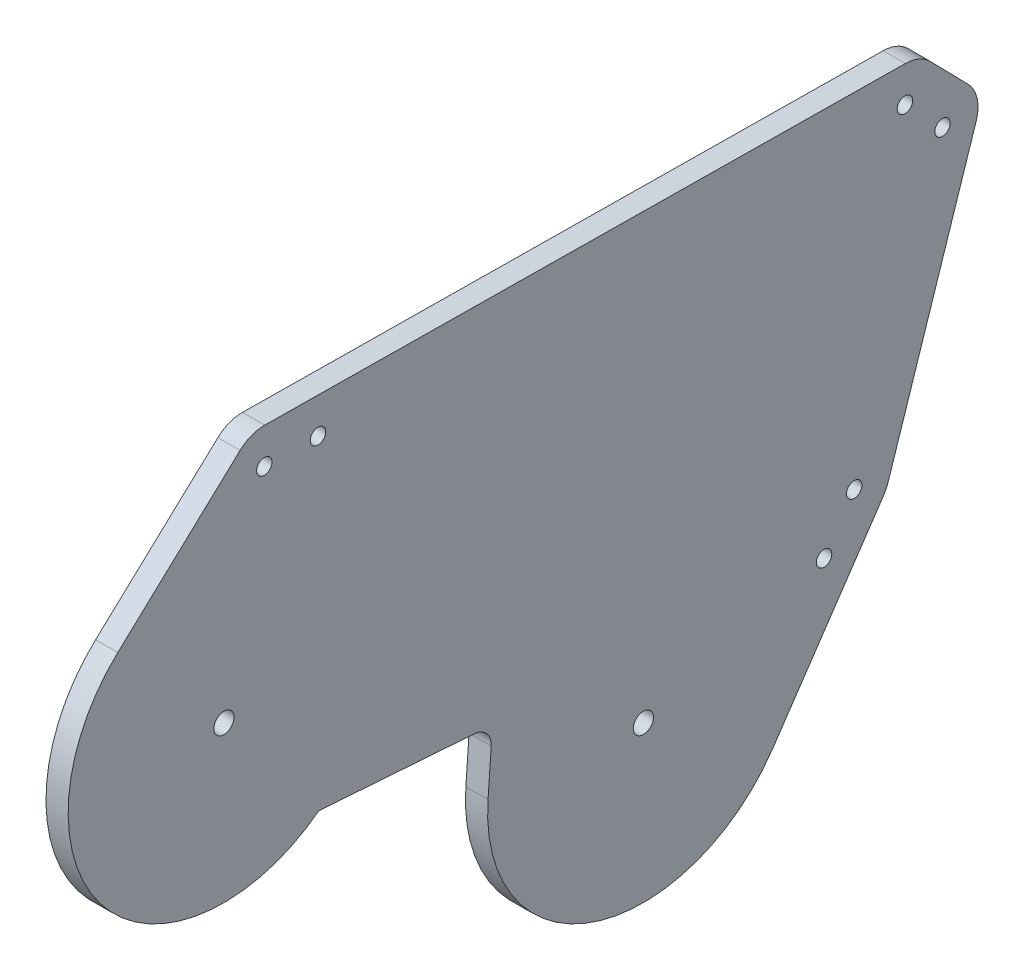
ISO-10303-21;
HEADER;
FILE_DESCRIPTION(('STEP AP214'),'2;1');
FILE_NAME('part.step','',(''),(''),'','','');
FILE_SCHEMA(('AUTOMOTIVE_DESIGN { 1 0 10303 214 1 1 1 1 }'));
ENDSEC;
DATA;
#1=APPLICATION_CONTEXT('core data for automotive mechanical design processes');
#2=APPLICATION_PROTOCOL_DEFINITION('international standard','automotive_design',2000,#1);
#3=PRODUCT_CONTEXT('',#1,'mechanical');
#4=PRODUCT('Part','Part','',(#3));
#5=PRODUCT_RELATED_PRODUCT_CATEGORY('part','',(#4));
#6=PRODUCT_DEFINITION_FORMATION('','',#4);
#7=PRODUCT_DEFINITION_CONTEXT('part definition',#1,'design');
#8=PRODUCT_DEFINITION('design','',#6,#7);
#9=PRODUCT_DEFINITION_SHAPE('','',#8);
#10=(LENGTH_UNIT() NAMED_UNIT(*) SI_UNIT(.MILLI.,.METRE.));
#11=(NAMED_UNIT(*) PLANE_ANGLE_UNIT() SI_UNIT($,.RADIAN.));
#12=(NAMED_UNIT(*) SI_UNIT($,.STERADIAN.) SOLID_ANGLE_UNIT());
#13=UNCERTAINTY_MEASURE_WITH_UNIT(LENGTH_MEASURE(1.E-05),#10,'distance_accuracy_value','');
#14=(GEOMETRIC_REPRESENTATION_CONTEXT(3) GLOBAL_UNCERTAINTY_ASSIGNED_CONTEXT((#13)) GLOBAL_UNIT_ASSIGNED_CONTEXT((#10,
#11,#12)) REPRESENTATION_CONTEXT('',''));
#15=CARTESIAN_POINT('',(0.,0.,0.));
#16=DIRECTION('',(0.,0.,1.));
#17=DIRECTION('',(1.,0.,0.));
#18=AXIS2_PLACEMENT_3D('',#15,#16,#17);
#19=CARTESIAN_POINT('',(-4.953,-61.8421896626251,426.087206182307));
#20=DIRECTION('',(1.,0.,0.));
#21=DIRECTION('',(0.,0.,-1.));
#22=AXIS2_PLACEMENT_3D('',#19,#20,#21);
#23=CYLINDRICAL_SURFACE('',#22,34.8040999999982);
#24=CARTESIAN_POINT('',(0.,-61.8421896626251,426.087206182307));
#25=DIRECTION('',(1.,0.,0.));
#26=DIRECTION('',(0.,0.,-1.));
#27=AXIS2_PLACEMENT_3D('',#24,#25,#26);
#28=CIRCLE('',#27,34.8040999999982);
#29=CARTESIAN_POINT('',(0.,-59.3477658780429,460.801802921903));
#30=VERTEX_POINT('',#29);
#31=CARTESIAN_POINT('',(0.,-81.3641503491376,397.273694980717));
#32=VERTEX_POINT('',#31);
#33=EDGE_CURVE('E171',#30,#32,#28,.T.);
#34=ORIENTED_EDGE('',*,*,#33,.F.);
#35=DIRECTION('',(1.,0.,0.));
#36=VECTOR('',#35,1.);
#37=CARTESIAN_POINT('',(-4.953,-59.3477658780429,460.801802921903));
#38=LINE('',#37,#36);
#39=CARTESIAN_POINT('',(-4.953,-59.3477658780429,460.801802921903));
#40=VERTEX_POINT('',#39);
#41=EDGE_CURVE('E12',#40,#30,#38,.T.);
#42=ORIENTED_EDGE('',*,*,#41,.F.);
#43=CARTESIAN_POINT('',(-4.953,-61.8421896626251,426.087206182307));
#44=DIRECTION('',(1.,0.,0.));
#45=DIRECTION('',(0.,0.,-1.));
#46=AXIS2_PLACEMENT_3D('',#43,#44,#45);
#47=CIRCLE('',#46,34.8040999999982);
#48=CARTESIAN_POINT('',(-4.953,-81.3641503491376,397.273694980717));
#49=VERTEX_POINT('',#48);
#50=EDGE_CURVE('E246',#40,#49,#47,.T.);
#51=ORIENTED_EDGE('',*,*,#50,.T.);
#52=DIRECTION('',(1.,0.,0.));
#53=VECTOR('',#52,1.);
#54=CARTESIAN_POINT('',(-4.953,-81.3641503491376,397.273694980717));
#55=LINE('',#54,#53);
#56=EDGE_CURVE('E41',#49,#32,#55,.T.);
#57=ORIENTED_EDGE('',*,*,#56,.T.);
#58=EDGE_LOOP('',(#34,#42,#51,#57));
#59=FACE_BOUND('',#58,.T.);
#60=ADVANCED_FACE('F38',(#59),#23,.T.);
#61=CARTESIAN_POINT('',(-4.953,-59.3477658780429,460.801802921903));
#62=DIRECTION('',(0.,0.0716704004580626,0.9974283702092));
#63=DIRECTION('',(0.,-0.9974283702092,0.0716704004580626));
#64=AXIS2_PLACEMENT_3D('',#61,#62,#63);
#65=PLANE('',#64);
#66=DIRECTION('',(0.,-0.9974283702092,0.0716704004580626));
#67=VECTOR('',#66,1.);
#68=CARTESIAN_POINT('',(0.,-59.3477658780429,460.801802921903));
#69=LINE('',#68,#67);
#70=CARTESIAN_POINT('',(0.,-49.3734821759509,460.085098917322));
#71=VERTEX_POINT('',#70);
#72=EDGE_CURVE('E242',#71,#30,#69,.T.);
#73=ORIENTED_EDGE('',*,*,#72,.F.);
#74=DIRECTION('',(1.,0.,0.));
#75=VECTOR('',#74,1.);
#76=CARTESIAN_POINT('',(-4.953,-49.3734821759509,460.085098917322));
#77=LINE('',#76,#75);
#78=CARTESIAN_POINT('',(-4.953,-49.3734821759509,460.085098917322));
#79=VERTEX_POINT('',#78);
#80=EDGE_CURVE('E47',#79,#71,#77,.T.);
#81=ORIENTED_EDGE('',*,*,#80,.F.);
#82=DIRECTION('',(0.,-0.9974283702092,0.0716704004580626));
#83=VECTOR('',#82,1.);
#84=CARTESIAN_POINT('',(-4.953,-59.3477658780429,460.801802921903));
#85=LINE('',#84,#83);
#86=EDGE_CURVE('E161',#79,#40,#85,.T.);
#87=ORIENTED_EDGE('',*,*,#86,.T.);
#88=ORIENTED_EDGE('',*,*,#41,.T.);
#89=EDGE_LOOP('',(#73,#81,#87,#88));
#90=FACE_BOUND('',#89,.T.);
#91=ADVANCED_FACE('F272',(#90),#65,.T.);
#92=CARTESIAN_POINT('',(-4.953,-49.0868005741186,464.074812398159));
#93=DIRECTION('',(1.,0.,0.));
#94=DIRECTION('',(0.,0.,-1.));
#95=AXIS2_PLACEMENT_3D('',#92,#93,#94);
#96=CYLINDRICAL_SURFACE('',#95,4.);
#97=CARTESIAN_POINT('',(0.,-49.0868005741186,464.074812398159));
#98=DIRECTION('',(-1.,0.,0.));
#99=DIRECTION('',(0.,0.,1.));
#100=AXIS2_PLACEMENT_3D('',#97,#98,#99);
#101=CIRCLE('',#100,4.);
#102=CARTESIAN_POINT('',(0.,-45.0970870932818,463.788130796327));
#103=VERTEX_POINT('',#102);
#104=EDGE_CURVE('E148',#103,#71,#101,.T.);
#105=ORIENTED_EDGE('',*,*,#104,.F.);
#106=DIRECTION('',(1.,0.,0.));
#107=VECTOR('',#106,1.);
#108=CARTESIAN_POINT('',(-4.953,-45.0970870932818,463.788130796327));
#109=LINE('',#108,#107);
#110=CARTESIAN_POINT('',(-4.953,-45.0970870932818,463.788130796327));
#111=VERTEX_POINT('',#110);
#112=EDGE_CURVE('E143',#111,#103,#109,.T.);
#113=ORIENTED_EDGE('',*,*,#112,.F.);
#114=CARTESIAN_POINT('',(-4.953,-49.0868005741186,464.074812398159));
#115=DIRECTION('',(-1.,0.,0.));
#116=DIRECTION('',(0.,0.,1.));
#117=AXIS2_PLACEMENT_3D('',#114,#115,#116);
#118=CIRCLE('',#117,4.);
#119=EDGE_CURVE('E146',#111,#79,#118,.T.);
#120=ORIENTED_EDGE('',*,*,#119,.T.);
#121=ORIENTED_EDGE('',*,*,#80,.T.);
#122=EDGE_LOOP('',(#105,#113,#120,#121));
#123=FACE_BOUND('',#122,.T.);
#124=ADVANCED_FACE('F145',(#123),#96,.F.);
#125=CARTESIAN_POINT('',(-4.953,-42.5978831750404,498.569252082941));
#126=DIRECTION('',(0.,-0.9974283702092,0.0716704004580605));
#127=DIRECTION('',(0.,-0.0716704004580605,-0.9974283702092));
#128=AXIS2_PLACEMENT_3D('',#125,#126,#127);
#129=PLANE('',#128);
#130=DIRECTION('',(0.,-0.0716704004580605,-0.9974283702092));
#131=VECTOR('',#130,1.);
#132=CARTESIAN_POINT('',(0.,-42.5978831750404,498.569252082941));
#133=LINE('',#132,#131);
#134=CARTESIAN_POINT('',(0.,-42.5978831750405,498.569252082941));
#135=VERTEX_POINT('',#134);
#136=EDGE_CURVE('E236',#135,#103,#133,.T.);
#137=ORIENTED_EDGE('',*,*,#136,.F.);
#138=DIRECTION('',(1.,0.,0.));
#139=VECTOR('',#138,1.);
#140=CARTESIAN_POINT('',(-4.953,-42.5978831750405,498.569252082941));
#141=LINE('',#140,#139);
#142=CARTESIAN_POINT('',(-4.953,-42.5978831750405,498.569252082941));
#143=VERTEX_POINT('',#142);
#144=EDGE_CURVE('E153',#143,#135,#141,.T.);
#145=ORIENTED_EDGE('',*,*,#144,.F.);
#146=DIRECTION('',(0.,-0.0716704004580605,-0.9974283702092));
#147=VECTOR('',#146,1.);
#148=CARTESIAN_POINT('',(-4.953,-42.5978831750404,498.569252082941));
#149=LINE('',#148,#147);
#150=EDGE_CURVE('E159',#143,#111,#149,.T.);
#151=ORIENTED_EDGE('',*,*,#150,.T.);
#152=ORIENTED_EDGE('',*,*,#112,.T.);
#153=EDGE_LOOP('',(#137,#145,#151,#152));
#154=FACE_BOUND('',#153,.T.);
#155=ADVANCED_FACE('F163',(#154),#129,.T.);
#156=CARTESIAN_POINT('',(-4.953,-15.0065003575197,519.783421192923));
#157=DIRECTION('',(1.,0.,0.));
#158=DIRECTION('',(0.,0.,-1.));
#159=AXIS2_PLACEMENT_3D('',#156,#157,#158);
#160=CYLINDRICAL_SURFACE('',#159,34.8040999999986);
#161=CARTESIAN_POINT('',(0.,-15.0065003575197,519.783421192923));
#162=DIRECTION('',(1.,0.,0.));
#163=DIRECTION('',(0.,0.,-1.));
#164=AXIS2_PLACEMENT_3D('',#161,#162,#163);
#165=CIRCLE('',#164,34.8040999999986);
#166=CARTESIAN_POINT('',(0.,10.4622867101941,543.504008498244));
#167=VERTEX_POINT('',#166);
#168=EDGE_CURVE('E232',#167,#135,#165,.T.);
#169=ORIENTED_EDGE('',*,*,#168,.F.);
#170=DIRECTION('',(1.,0.,0.));
#171=VECTOR('',#170,1.);
#172=CARTESIAN_POINT('',(-4.953,10.4622867101941,543.504008498244));
#173=LINE('',#172,#171);
#174=CARTESIAN_POINT('',(-4.953,10.4622867101941,543.504008498244));
#175=VERTEX_POINT('',#174);
#176=EDGE_CURVE('E250',#175,#167,#173,.T.);
#177=ORIENTED_EDGE('',*,*,#176,.F.);
#178=CARTESIAN_POINT('',(-4.953,-15.0065003575197,519.783421192923));
#179=DIRECTION('',(1.,0.,0.));
#180=DIRECTION('',(0.,0.,-1.));
#181=AXIS2_PLACEMENT_3D('',#178,#179,#180);
#182=CIRCLE('',#181,34.8040999999986);
#183=EDGE_CURVE('E164',#175,#143,#182,.T.);
#184=ORIENTED_EDGE('',*,*,#183,.T.);
#185=ORIENTED_EDGE('',*,*,#144,.T.);
#186=EDGE_LOOP('',(#169,#177,#184,#185));
#187=FACE_BOUND('',#186,.T.);
#188=ADVANCED_FACE('F285',(#187),#160,.T.);
#189=CARTESIAN_POINT('',(-4.953,35.9103864393411,516.180391888878));
#190=DIRECTION('',(0.,0.7317754824206,0.681545774932321));
#191=DIRECTION('',(0.,-0.681545774932321,0.7317754824206));
#192=AXIS2_PLACEMENT_3D('',#189,#190,#191);
#193=PLANE('',#192);
#194=DIRECTION('',(0.,-0.681545774932321,0.7317754824206));
#195=VECTOR('',#194,1.);
#196=CARTESIAN_POINT('',(0.,35.9103864393411,516.180391888878));
#197=LINE('',#196,#195);
#198=CARTESIAN_POINT('',(0.,35.9103864393417,516.180391888879));
#199=VERTEX_POINT('',#198);
#200=EDGE_CURVE('E225',#199,#167,#197,.T.);
#201=ORIENTED_EDGE('',*,*,#200,.F.);
#202=DIRECTION('',(1.,0.,0.));
#203=VECTOR('',#202,1.);
#204=CARTESIAN_POINT('',(-4.953,35.9103864393417,516.180391888879));
#205=LINE('',#204,#203);
#206=CARTESIAN_POINT('',(-4.953,35.9103864393417,516.180391888879));
#207=VERTEX_POINT('',#206);
#208=EDGE_CURVE('E252',#207,#199,#205,.T.);
#209=ORIENTED_EDGE('',*,*,#208,.F.);
#210=DIRECTION('',(0.,-0.681545774932321,0.7317754824206));
#211=VECTOR('',#210,1.);
#212=CARTESIAN_POINT('',(-4.953,35.9103864393411,516.180391888878));
#213=LINE('',#212,#211);
#214=EDGE_CURVE('E166',#207,#175,#213,.T.);
#215=ORIENTED_EDGE('',*,*,#214,.T.);
#216=ORIENTED_EDGE('',*,*,#176,.T.);
#217=EDGE_LOOP('',(#201,#209,#215,#216));
#218=FACE_BOUND('',#217,.T.);
#219=ADVANCED_FACE('F288',(#218),#193,.T.);
#220=CARTESIAN_POINT('',(-4.953,30.1019185476259,510.770622300354));
#221=DIRECTION('',(1.,0.,0.));
#222=DIRECTION('',(0.,0.,-1.));
#223=AXIS2_PLACEMENT_3D('',#220,#221,#222);
#224=CYLINDRICAL_SURFACE('',#223,7.93750000000153);
#225=CARTESIAN_POINT('',(0.,30.1019185476259,510.770622300354));
#226=DIRECTION('',(1.,0.,0.));
#227=DIRECTION('',(0.,0.,1.));
#228=AXIS2_PLACEMENT_3D('',#225,#226,#227);
#229=CIRCLE('',#228,7.93750000000153);
#230=CARTESIAN_POINT('',(0.,38.0389259271998,510.682190933593));
#231=VERTEX_POINT('',#230);
#232=EDGE_CURVE('E220',#231,#199,#229,.T.);
#233=ORIENTED_EDGE('',*,*,#232,.F.);
#234=DIRECTION('',(1.,0.,0.));
#235=VECTOR('',#234,1.);
#236=CARTESIAN_POINT('',(-4.953,38.0389259271998,510.682190933593));
#237=LINE('',#236,#235);
#238=CARTESIAN_POINT('',(-4.953,38.0389259271998,510.682190933593));
#239=VERTEX_POINT('',#238);
#240=EDGE_CURVE('E254',#239,#231,#237,.T.);
#241=ORIENTED_EDGE('',*,*,#240,.F.);
#242=CARTESIAN_POINT('',(-4.953,30.1019185476259,510.770622300354));
#243=DIRECTION('',(1.,0.,0.));
#244=DIRECTION('',(0.,0.,1.));
#245=AXIS2_PLACEMENT_3D('',#242,#243,#244);
#246=CIRCLE('',#245,7.93750000000153);
#247=EDGE_CURVE('E455',#239,#207,#246,.T.);
#248=ORIENTED_EDGE('',*,*,#247,.T.);
#249=ORIENTED_EDGE('',*,*,#208,.T.);
#250=EDGE_LOOP('',(#233,#241,#248,#249));
#251=FACE_BOUND('',#250,.T.);
#252=ADVANCED_FACE('F292',(#251),#224,.T.);
#253=CARTESIAN_POINT('',(-4.953,36.4445127908391,367.578343357796));
#254=DIRECTION('',(0.,0.999937937583819,-0.0111409595914925));
#255=DIRECTION('',(0.,0.0111409595914925,0.999937937583819));
#256=AXIS2_PLACEMENT_3D('',#253,#254,#255);
#257=PLANE('',#256);
#258=DIRECTION('',(0.,0.0111409595914925,0.999937937583819));
#259=VECTOR('',#258,1.);
#260=CARTESIAN_POINT('',(0.,36.4445127908391,367.578343357796));
#261=LINE('',#260,#259);
#262=CARTESIAN_POINT('',(0.,36.4445127908391,367.578343357796));
#263=VERTEX_POINT('',#262);
#264=EDGE_CURVE('E215',#263,#231,#261,.T.);
#265=ORIENTED_EDGE('',*,*,#264,.F.);
#266=DIRECTION('',(1.,0.,0.));
#267=VECTOR('',#266,1.);
#268=CARTESIAN_POINT('',(-4.953,36.4445127908391,367.578343357796));
#269=LINE('',#268,#267);
#270=CARTESIAN_POINT('',(-4.953,36.4445127908391,367.578343357796));
#271=VERTEX_POINT('',#270);
#272=EDGE_CURVE('E256',#271,#263,#269,.T.);
#273=ORIENTED_EDGE('',*,*,#272,.F.);
#274=DIRECTION('',(0.,0.0111409595914925,0.999937937583819));
#275=VECTOR('',#274,1.);
#276=CARTESIAN_POINT('',(-4.953,36.4445127908391,367.578343357796));
#277=LINE('',#276,#275);
#278=EDGE_CURVE('E452',#271,#239,#277,.T.);
#279=ORIENTED_EDGE('',*,*,#278,.T.);
#280=ORIENTED_EDGE('',*,*,#240,.T.);
#281=EDGE_LOOP('',(#265,#273,#279,#280));
#282=FACE_BOUND('',#281,.T.);
#283=ADVANCED_FACE('F296',(#282),#257,.T.);
#284=CARTESIAN_POINT('',(-4.953,28.5075054112675,367.666774724554));
#285=DIRECTION('',(1.,0.,0.));
#286=DIRECTION('',(0.,0.,-1.));
#287=AXIS2_PLACEMENT_3D('',#284,#285,#286);
#288=CYLINDRICAL_SURFACE('',#287,7.9375);
#289=CARTESIAN_POINT('',(0.,28.5075054112675,367.666774724554));
#290=DIRECTION('',(1.,0.,0.));
#291=DIRECTION('',(0.,0.,-1.));
#292=AXIS2_PLACEMENT_3D('',#289,#290,#291);
#293=CIRCLE('',#292,7.9375);
#294=CARTESIAN_POINT('',(0.,34.0572867325866,361.991932565027));
#295=VERTEX_POINT('',#294);
#296=EDGE_CURVE('E211',#295,#263,#293,.T.);
#297=ORIENTED_EDGE('',*,*,#296,.F.);
#298=DIRECTION('',(1.,0.,0.));
#299=VECTOR('',#298,1.);
#300=CARTESIAN_POINT('',(-4.953,34.0572867325866,361.991932565027));
#301=LINE('',#300,#299);
#302=CARTESIAN_POINT('',(-4.953,34.0572867325866,361.991932565027));
#303=VERTEX_POINT('',#302);
#304=EDGE_CURVE('E258',#303,#295,#301,.T.);
#305=ORIENTED_EDGE('',*,*,#304,.F.);
#306=CARTESIAN_POINT('',(-4.953,28.5075054112675,367.666774724554));
#307=DIRECTION('',(1.,0.,0.));
#308=DIRECTION('',(0.,0.,-1.));
#309=AXIS2_PLACEMENT_3D('',#306,#307,#308);
#310=CIRCLE('',#309,7.9375);
#311=EDGE_CURVE('E449',#303,#271,#310,.T.);
#312=ORIENTED_EDGE('',*,*,#311,.T.);
#313=ORIENTED_EDGE('',*,*,#272,.T.);
#314=EDGE_LOOP('',(#297,#305,#312,#313));
#315=FACE_BOUND('',#314,.T.);
#316=ADVANCED_FACE('F300',(#315),#288,.T.);
#317=CARTESIAN_POINT('',(-4.953,25.4779977984995,353.601711984765));
#318=DIRECTION('',(0.,0.69918504835516,-0.714940744507258));
#319=DIRECTION('',(0.,0.714940744507258,0.69918504835516));
#320=AXIS2_PLACEMENT_3D('',#317,#318,#319);
#321=PLANE('',#320);
#322=DIRECTION('',(0.,0.714940744507258,0.69918504835516));
#323=VECTOR('',#322,1.);
#324=CARTESIAN_POINT('',(0.,25.4779977984995,353.601711984765));
#325=LINE('',#324,#323);
#326=CARTESIAN_POINT('',(0.,25.4779977984995,353.601711984765));
#327=VERTEX_POINT('',#326);
#328=EDGE_CURVE('E203',#327,#295,#325,.T.);
#329=ORIENTED_EDGE('',*,*,#328,.F.);
#330=DIRECTION('',(1.,0.,0.));
#331=VECTOR('',#330,1.);
#332=CARTESIAN_POINT('',(-4.953,25.4779977984995,353.601711984765));
#333=LINE('',#332,#331);
#334=CARTESIAN_POINT('',(-4.953,25.4779977984995,353.601711984765));
#335=VERTEX_POINT('',#334);
#336=EDGE_CURVE('E260',#335,#327,#333,.T.);
#337=ORIENTED_EDGE('',*,*,#336,.F.);
#338=DIRECTION('',(0.,0.714940744507258,0.69918504835516));
#339=VECTOR('',#338,1.);
#340=CARTESIAN_POINT('',(-4.953,25.4779977984995,353.601711984765));
#341=LINE('',#340,#339);
#342=EDGE_CURVE('E446',#335,#303,#341,.T.);
#343=ORIENTED_EDGE('',*,*,#342,.T.);
#344=ORIENTED_EDGE('',*,*,#304,.T.);
#345=EDGE_LOOP('',(#329,#337,#343,#344));
#346=FACE_BOUND('',#345,.T.);
#347=ADVANCED_FACE('F304',(#346),#321,.T.);
#348=CARTESIAN_POINT('',(-4.953,19.9282164771804,359.276554144292));
#349=DIRECTION('',(1.,0.,0.));
#350=DIRECTION('',(0.,0.,-1.));
#351=AXIS2_PLACEMENT_3D('',#348,#349,#350);
#352=CYLINDRICAL_SURFACE('',#351,7.93749999999999);
#353=CARTESIAN_POINT('',(0.,19.9282164771804,359.276554144292));
#354=DIRECTION('',(1.,0.,0.));
#355=DIRECTION('',(0.,0.,1.));
#356=AXIS2_PLACEMENT_3D('',#353,#354,#355);
#357=CIRCLE('',#356,7.93749999999999);
#358=CARTESIAN_POINT('',(0.,17.4554228246703,351.734061333416));
#359=VERTEX_POINT('',#358);
#360=EDGE_CURVE('E198',#359,#327,#357,.T.);
#361=ORIENTED_EDGE('',*,*,#360,.F.);
#362=DIRECTION('',(1.,0.,0.));
#363=VECTOR('',#362,1.);
#364=CARTESIAN_POINT('',(-4.953,17.4554228246703,351.734061333416));
#365=LINE('',#364,#363);
#366=CARTESIAN_POINT('',(-4.953,17.4554228246703,351.734061333416));
#367=VERTEX_POINT('',#366);
#368=EDGE_CURVE('E262',#367,#359,#365,.T.);
#369=ORIENTED_EDGE('',*,*,#368,.F.);
#370=CARTESIAN_POINT('',(-4.953,19.9282164771804,359.276554144292));
#371=DIRECTION('',(1.,0.,0.));
#372=DIRECTION('',(0.,0.,1.));
#373=AXIS2_PLACEMENT_3D('',#370,#371,#372);
#374=CIRCLE('',#373,7.93749999999999);
#375=EDGE_CURVE('E443',#367,#335,#374,.T.);
#376=ORIENTED_EDGE('',*,*,#375,.T.);
#377=ORIENTED_EDGE('',*,*,#336,.T.);
#378=EDGE_LOOP('',(#361,#369,#376,#377));
#379=FACE_BOUND('',#378,.T.);
#380=ADVANCED_FACE('F308',(#379),#352,.T.);
#381=CARTESIAN_POINT('',(-4.953,-42.7239293019611,371.463761272453));
#382=DIRECTION('',(0.,-0.311533058583954,-0.950235314755943));
#383=DIRECTION('',(0.,0.950235314755943,-0.311533058583954));
#384=AXIS2_PLACEMENT_3D('',#381,#382,#383);
#385=PLANE('',#384);
#386=DIRECTION('',(0.,0.950235314755943,-0.311533058583954));
#387=VECTOR('',#386,1.);
#388=CARTESIAN_POINT('',(0.,-42.7239293019611,371.463761272453));
#389=LINE('',#388,#387);
#390=CARTESIAN_POINT('',(0.,-42.7239293019612,371.463761272453));
#391=VERTEX_POINT('',#390);
#392=EDGE_CURVE('E193',#391,#359,#389,.T.);
#393=ORIENTED_EDGE('',*,*,#392,.F.);
#394=DIRECTION('',(1.,0.,0.));
#395=VECTOR('',#394,1.);
#396=CARTESIAN_POINT('',(-4.953,-42.7239293019612,371.463761272453));
#397=LINE('',#396,#395);
#398=CARTESIAN_POINT('',(-4.953,-42.7239293019612,371.463761272453));
#399=VERTEX_POINT('',#398);
#400=EDGE_CURVE('E264',#399,#391,#397,.T.);
#401=ORIENTED_EDGE('',*,*,#400,.F.);
#402=DIRECTION('',(0.,0.950235314755943,-0.311533058583954));
#403=VECTOR('',#402,1.);
#404=CARTESIAN_POINT('',(-4.953,-42.7239293019611,371.463761272453));
#405=LINE('',#404,#403);
#406=EDGE_CURVE('E440',#399,#367,#405,.T.);
#407=ORIENTED_EDGE('',*,*,#406,.T.);
#408=ORIENTED_EDGE('',*,*,#368,.T.);
#409=EDGE_LOOP('',(#393,#401,#407,#408));
#410=FACE_BOUND('',#409,.T.);
#411=ADVANCED_FACE('F312',(#410),#385,.T.);
#412=CARTESIAN_POINT('',(-4.953,-40.251135649451,379.006254083328));
#413=DIRECTION('',(1.,0.,0.));
#414=DIRECTION('',(0.,0.,-1.));
#415=AXIS2_PLACEMENT_3D('',#412,#413,#414);
#416=CYLINDRICAL_SURFACE('',#415,7.93749999999999);
#417=CARTESIAN_POINT('',(0.,-40.251135649451,379.006254083328));
#418=DIRECTION('',(1.,0.,0.));
#419=DIRECTION('',(0.,0.,-1.));
#420=AXIS2_PLACEMENT_3D('',#417,#418,#419);
#421=CIRCLE('',#420,7.93749999999999);
#422=CARTESIAN_POINT('',(0.,-44.7033571678699,372.434981010252));
#423=VERTEX_POINT('',#422);
#424=EDGE_CURVE('E189',#423,#391,#421,.T.);
#425=ORIENTED_EDGE('',*,*,#424,.F.);
#426=DIRECTION('',(1.,0.,0.));
#427=VECTOR('',#426,1.);
#428=CARTESIAN_POINT('',(-4.953,-44.7033571678699,372.434981010252));
#429=LINE('',#428,#427);
#430=CARTESIAN_POINT('',(-4.953,-44.7033571678699,372.434981010252));
#431=VERTEX_POINT('',#430);
#432=EDGE_CURVE('E265',#431,#423,#429,.T.);
#433=ORIENTED_EDGE('',*,*,#432,.F.);
#434=CARTESIAN_POINT('',(-4.953,-40.251135649451,379.006254083328));
#435=DIRECTION('',(1.,0.,0.));
#436=DIRECTION('',(0.,0.,-1.));
#437=AXIS2_PLACEMENT_3D('',#434,#435,#436);
#438=CIRCLE('',#437,7.93749999999999);
#439=EDGE_CURVE('E437',#431,#399,#438,.T.);
#440=ORIENTED_EDGE('',*,*,#439,.T.);
#441=ORIENTED_EDGE('',*,*,#400,.T.);
#442=EDGE_LOOP('',(#425,#433,#440,#441));
#443=FACE_BOUND('',#442,.T.);
#444=ADVANCED_FACE('F316',(#443),#416,.T.);
#445=CARTESIAN_POINT('',(-4.953,-81.3641503491376,397.273694980717));
#446=DIRECTION('',(0.,-0.560909797596073,-0.8278769225922));
#447=DIRECTION('',(0.,0.8278769225922,-0.560909797596074));
#448=AXIS2_PLACEMENT_3D('',#445,#446,#447);
#449=PLANE('',#448);
#450=DIRECTION('',(0.,0.8278769225922,-0.560909797596073));
#451=VECTOR('',#450,1.);
#452=CARTESIAN_POINT('',(0.,-81.3641503491376,397.273694980717));
#453=LINE('',#452,#451);
#454=EDGE_CURVE('E176',#32,#423,#453,.T.);
#455=ORIENTED_EDGE('',*,*,#454,.F.);
#456=ORIENTED_EDGE('',*,*,#56,.F.);
#457=DIRECTION('',(0.,0.8278769225922,-0.560909797596073));
#458=VECTOR('',#457,1.);
#459=CARTESIAN_POINT('',(-4.953,-81.3641503491376,397.273694980717));
#460=LINE('',#459,#458);
#461=EDGE_CURVE('E435',#49,#431,#460,.T.);
#462=ORIENTED_EDGE('',*,*,#461,.T.);
#463=ORIENTED_EDGE('',*,*,#432,.T.);
#464=EDGE_LOOP('',(#455,#456,#462,#463));
#465=FACE_BOUND('',#464,.T.);
#466=ADVANCED_FACE('F268',(#465),#449,.T.);
#467=CARTESIAN_POINT('',(-4.953,-61.8421896626251,426.087206182307));
#468=DIRECTION('',(1.,0.,0.));
#469=DIRECTION('',(0.,0.,-1.));
#470=AXIS2_PLACEMENT_3D('',#467,#468,#469);
#471=PLANE('',#470);
#472=CARTESIAN_POINT('',(-4.953,29.9682270325283,498.771367049348));
#473=DIRECTION('',(1.,0.,0.));
#474=DIRECTION('',(0.,0.,-1.));
#475=AXIS2_PLACEMENT_3D('',#472,#473,#474);
#476=CIRCLE('',#475,1.72719999999997);
#477=CARTESIAN_POINT('',(-4.953,29.9682270325283,497.044167049348));
#478=VERTEX_POINT('',#477);
#479=EDGE_CURVE('E367',#478,#478,#476,.T.);
#480=ORIENTED_EDGE('',*,*,#479,.T.);
#481=EDGE_LOOP('',(#480));
#482=FACE_BOUND('',#481,.T.);
#483=CARTESIAN_POINT('',(-4.953,-40.251135649451,379.006254083328));
#484=DIRECTION('',(1.,0.,0.));
#485=DIRECTION('',(0.,0.,-1.));
#486=AXIS2_PLACEMENT_3D('',#483,#484,#485);
#487=CIRCLE('',#486,1.72719999999997);
#488=CARTESIAN_POINT('',(-4.953,-40.251135649451,377.279054083328));
#489=VERTEX_POINT('',#488);
#490=EDGE_CURVE('E378',#489,#489,#487,.T.);
#491=ORIENTED_EDGE('',*,*,#490,.T.);
#492=EDGE_LOOP('',(#491));
#493=FACE_BOUND('',#492,.T.);
#494=CARTESIAN_POINT('',(-4.953,28.5075054112675,367.666774724554));
#495=DIRECTION('',(1.,0.,0.));
#496=DIRECTION('',(0.,0.,-1.));
#497=AXIS2_PLACEMENT_3D('',#494,#495,#496);
#498=CIRCLE('',#497,1.72719999999997);
#499=CARTESIAN_POINT('',(-4.953,28.5075054112675,365.939574724554));
#500=VERTEX_POINT('',#499);
#501=EDGE_CURVE('E388',#500,#500,#498,.T.);
#502=ORIENTED_EDGE('',*,*,#501,.T.);
#503=EDGE_LOOP('',(#502));
#504=FACE_BOUND('',#503,.T.);
#505=CARTESIAN_POINT('',(-4.953,-50.185658720557,385.737171654481));
#506=DIRECTION('',(1.,0.,0.));
#507=DIRECTION('',(0.,0.,-1.));
#508=AXIS2_PLACEMENT_3D('',#505,#506,#507);
#509=CIRCLE('',#508,1.72719999999997);
#510=CARTESIAN_POINT('',(-4.953,-50.185658720557,384.009971654481));
#511=VERTEX_POINT('',#510);
#512=EDGE_CURVE('E396',#511,#511,#509,.T.);
#513=ORIENTED_EDGE('',*,*,#512,.T.);
#514=EDGE_LOOP('',(#513));
#515=FACE_BOUND('',#514,.T.);
#516=CARTESIAN_POINT('',(-4.953,-15.0065003575198,519.783421192923));
#517=DIRECTION('',(1.,0.,0.));
#518=DIRECTION('',(0.,0.,-1.));
#519=AXIS2_PLACEMENT_3D('',#516,#517,#518);
#520=CIRCLE('',#519,2.25424999999999);
#521=CARTESIAN_POINT('',(-4.953,-15.0065003575198,517.529171192923));
#522=VERTEX_POINT('',#521);
#523=EDGE_CURVE('E404',#522,#522,#520,.T.);
#524=ORIENTED_EDGE('',*,*,#523,.T.);
#525=EDGE_LOOP('',(#524));
#526=FACE_BOUND('',#525,.T.);
#527=CARTESIAN_POINT('',(-4.953,19.9282164771804,359.276554144292));
#528=DIRECTION('',(1.,0.,0.));
#529=DIRECTION('',(0.,0.,-1.));
#530=AXIS2_PLACEMENT_3D('',#527,#528,#529);
#531=CIRCLE('',#530,1.72719999999997);
#532=CARTESIAN_POINT('',(-4.953,19.9282164771804,357.549354144292));
#533=VERTEX_POINT('',#532);
#534=EDGE_CURVE('E413',#533,#533,#531,.T.);
#535=ORIENTED_EDGE('',*,*,#534,.T.);
#536=EDGE_LOOP('',(#535));
#537=FACE_BOUND('',#536,.T.);
#538=CARTESIAN_POINT('',(-4.953,-61.8421896626251,426.087206182307));
#539=DIRECTION('',(1.,0.,0.));
#540=DIRECTION('',(0.,0.,-1.));
#541=AXIS2_PLACEMENT_3D('',#538,#539,#540);
#542=CIRCLE('',#541,2.25424999999999);
#543=CARTESIAN_POINT('',(-4.953,-61.8421896626251,423.832956182307));
#544=VERTEX_POINT('',#543);
#545=EDGE_CURVE('E421',#544,#544,#542,.T.);
#546=ORIENTED_EDGE('',*,*,#545,.T.);
#547=EDGE_LOOP('',(#546));
#548=FACE_BOUND('',#547,.T.);
#549=CARTESIAN_POINT('',(-4.953,30.1019185476259,510.770622300354));
#550=DIRECTION('',(1.,0.,0.));
#551=DIRECTION('',(0.,0.,-1.));
#552=AXIS2_PLACEMENT_3D('',#549,#550,#551);
#553=CIRCLE('',#552,1.72720000000008);
#554=CARTESIAN_POINT('',(-4.953,30.1019185476259,509.043422300354));
#555=VERTEX_POINT('',#554);
#556=EDGE_CURVE('E177',#555,#555,#553,.T.);
#557=ORIENTED_EDGE('',*,*,#556,.T.);
#558=EDGE_LOOP('',(#557));
#559=FACE_BOUND('',#558,.T.);
#560=ORIENTED_EDGE('',*,*,#50,.F.);
#561=ORIENTED_EDGE('',*,*,#86,.F.);
#562=ORIENTED_EDGE('',*,*,#119,.F.);
#563=ORIENTED_EDGE('',*,*,#150,.F.);
#564=ORIENTED_EDGE('',*,*,#183,.F.);
#565=ORIENTED_EDGE('',*,*,#214,.F.);
#566=ORIENTED_EDGE('',*,*,#247,.F.);
#567=ORIENTED_EDGE('',*,*,#278,.F.);
#568=ORIENTED_EDGE('',*,*,#311,.F.);
#569=ORIENTED_EDGE('',*,*,#342,.F.);
#570=ORIENTED_EDGE('',*,*,#375,.F.);
#571=ORIENTED_EDGE('',*,*,#406,.F.);
#572=ORIENTED_EDGE('',*,*,#439,.F.);
#573=ORIENTED_EDGE('',*,*,#461,.F.);
#574=EDGE_LOOP('',(#560,#561,#562,#563,#564,#565,#566,#567,#568,#569,#570,#571,#572,#573));
#575=FACE_BOUND('',#574,.T.);
#576=ADVANCED_FACE('F157',(#482,#493,#504,#515,#526,#537,#548,#559,#575),#471,.F.);
#577=CARTESIAN_POINT('',(0.,-61.8421896626251,426.087206182307));
#578=DIRECTION('',(1.,0.,0.));
#579=DIRECTION('',(0.,0.,-1.));
#580=AXIS2_PLACEMENT_3D('',#577,#578,#579);
#581=PLANE('',#580);
#582=CARTESIAN_POINT('',(0.,29.9682270325283,498.771367049348));
#583=DIRECTION('',(1.,0.,0.));
#584=DIRECTION('',(0.,0.,-1.));
#585=AXIS2_PLACEMENT_3D('',#582,#583,#584);
#586=CIRCLE('',#585,1.72719999999997);
#587=CARTESIAN_POINT('',(0.,29.9682270325283,497.044167049348));
#588=VERTEX_POINT('',#587);
#589=EDGE_CURVE('E370',#588,#588,#586,.T.);
#590=ORIENTED_EDGE('',*,*,#589,.F.);
#591=EDGE_LOOP('',(#590));
#592=FACE_BOUND('',#591,.T.);
#593=CARTESIAN_POINT('',(0.,-40.251135649451,379.006254083328));
#594=DIRECTION('',(1.,0.,0.));
#595=DIRECTION('',(0.,0.,-1.));
#596=AXIS2_PLACEMENT_3D('',#593,#594,#595);
#597=CIRCLE('',#596,1.72719999999997);
#598=CARTESIAN_POINT('',(0.,-40.251135649451,377.279054083328));
#599=VERTEX_POINT('',#598);
#600=EDGE_CURVE('E374',#599,#599,#597,.T.);
#601=ORIENTED_EDGE('',*,*,#600,.F.);
#602=EDGE_LOOP('',(#601));
#603=FACE_BOUND('',#602,.T.);
#604=CARTESIAN_POINT('',(0.,28.5075054112675,367.666774724554));
#605=DIRECTION('',(1.,0.,0.));
#606=DIRECTION('',(0.,0.,-1.));
#607=AXIS2_PLACEMENT_3D('',#604,#605,#606);
#608=CIRCLE('',#607,1.72719999999997);
#609=CARTESIAN_POINT('',(0.,28.5075054112675,365.939574724554));
#610=VERTEX_POINT('',#609);
#611=EDGE_CURVE('E391',#610,#610,#608,.T.);
#612=ORIENTED_EDGE('',*,*,#611,.F.);
#613=EDGE_LOOP('',(#612));
#614=FACE_BOUND('',#613,.T.);
#615=CARTESIAN_POINT('',(0.,-50.185658720557,385.737171654481));
#616=DIRECTION('',(1.,0.,0.));
#617=DIRECTION('',(0.,0.,-1.));
#618=AXIS2_PLACEMENT_3D('',#615,#616,#617);
#619=CIRCLE('',#618,1.72719999999997);
#620=CARTESIAN_POINT('',(0.,-50.185658720557,384.009971654481));
#621=VERTEX_POINT('',#620);
#622=EDGE_CURVE('E390',#621,#621,#619,.T.);
#623=ORIENTED_EDGE('',*,*,#622,.F.);
#624=EDGE_LOOP('',(#623));
#625=FACE_BOUND('',#624,.T.);
#626=CARTESIAN_POINT('',(0.,-15.0065003575198,519.783421192923));
#627=DIRECTION('',(1.,0.,0.));
#628=DIRECTION('',(0.,0.,-1.));
#629=AXIS2_PLACEMENT_3D('',#626,#627,#628);
#630=CIRCLE('',#629,2.25424999999999);
#631=CARTESIAN_POINT('',(0.,-15.0065003575198,517.529171192923));
#632=VERTEX_POINT('',#631);
#633=EDGE_CURVE('E399',#632,#632,#630,.T.);
#634=ORIENTED_EDGE('',*,*,#633,.F.);
#635=EDGE_LOOP('',(#634));
#636=FACE_BOUND('',#635,.T.);
#637=CARTESIAN_POINT('',(0.,19.9282164771804,359.276554144292));
#638=DIRECTION('',(1.,0.,0.));
#639=DIRECTION('',(0.,0.,-1.));
#640=AXIS2_PLACEMENT_3D('',#637,#638,#639);
#641=CIRCLE('',#640,1.72719999999997);
#642=CARTESIAN_POINT('',(0.,19.9282164771804,357.549354144292));
#643=VERTEX_POINT('',#642);
#644=EDGE_CURVE('E416',#643,#643,#641,.T.);
#645=ORIENTED_EDGE('',*,*,#644,.F.);
#646=EDGE_LOOP('',(#645));
#647=FACE_BOUND('',#646,.T.);
#648=CARTESIAN_POINT('',(0.,-61.8421896626251,426.087206182307));
#649=DIRECTION('',(1.,0.,0.));
#650=DIRECTION('',(0.,0.,-1.));
#651=AXIS2_PLACEMENT_3D('',#648,#649,#650);
#652=CIRCLE('',#651,2.25424999999999);
#653=CARTESIAN_POINT('',(0.,-61.8421896626251,423.832956182307));
#654=VERTEX_POINT('',#653);
#655=EDGE_CURVE('E415',#654,#654,#652,.T.);
#656=ORIENTED_EDGE('',*,*,#655,.F.);
#657=EDGE_LOOP('',(#656));
#658=FACE_BOUND('',#657,.T.);
#659=CARTESIAN_POINT('',(0.,30.1019185476259,510.770622300354));
#660=DIRECTION('',(1.,0.,0.));
#661=DIRECTION('',(0.,0.,-1.));
#662=AXIS2_PLACEMENT_3D('',#659,#660,#661);
#663=CIRCLE('',#662,1.72720000000008);
#664=CARTESIAN_POINT('',(0.,30.1019185476259,509.043422300354));
#665=VERTEX_POINT('',#664);
#666=EDGE_CURVE('E424',#665,#665,#663,.T.);
#667=ORIENTED_EDGE('',*,*,#666,.F.);
#668=EDGE_LOOP('',(#667));
#669=FACE_BOUND('',#668,.T.);
#670=ORIENTED_EDGE('',*,*,#33,.T.);
#671=ORIENTED_EDGE('',*,*,#454,.T.);
#672=ORIENTED_EDGE('',*,*,#424,.T.);
#673=ORIENTED_EDGE('',*,*,#392,.T.);
#674=ORIENTED_EDGE('',*,*,#360,.T.);
#675=ORIENTED_EDGE('',*,*,#328,.T.);
#676=ORIENTED_EDGE('',*,*,#296,.T.);
#677=ORIENTED_EDGE('',*,*,#264,.T.);
#678=ORIENTED_EDGE('',*,*,#232,.T.);
#679=ORIENTED_EDGE('',*,*,#200,.T.);
#680=ORIENTED_EDGE('',*,*,#168,.T.);
#681=ORIENTED_EDGE('',*,*,#136,.T.);
#682=ORIENTED_EDGE('',*,*,#104,.T.);
#683=ORIENTED_EDGE('',*,*,#72,.T.);
#684=EDGE_LOOP('',(#670,#671,#672,#673,#674,#675,#676,#677,#678,#679,#680,#681,#682,#683));
#685=FACE_BOUND('',#684,.T.);
#686=ADVANCED_FACE('F271',(#592,#603,#614,#625,#636,#647,#658,#669,#685),#581,.T.);
#687=CARTESIAN_POINT('',(-4.953,30.1019185476259,510.770622300354));
#688=DIRECTION('',(1.,0.,0.));
#689=DIRECTION('',(0.,0.,-1.));
#690=AXIS2_PLACEMENT_3D('',#687,#688,#689);
#691=CYLINDRICAL_SURFACE('',#690,1.72720000000008);
#692=ORIENTED_EDGE('',*,*,#556,.F.);
#693=EDGE_LOOP('',(#692));
#694=FACE_BOUND('',#693,.T.);
#695=ORIENTED_EDGE('',*,*,#666,.T.);
#696=EDGE_LOOP('',(#695));
#697=FACE_BOUND('',#696,.T.);
#698=ADVANCED_FACE('F328',(#694,#697),#691,.F.);
#699=CARTESIAN_POINT('',(-4.953,-61.8421896626251,426.087206182307));
#700=DIRECTION('',(1.,0.,0.));
#701=DIRECTION('',(0.,0.,-1.));
#702=AXIS2_PLACEMENT_3D('',#699,#700,#701);
#703=CYLINDRICAL_SURFACE('',#702,2.25424999999999);
#704=ORIENTED_EDGE('',*,*,#545,.F.);
#705=EDGE_LOOP('',(#704));
#706=FACE_BOUND('',#705,.T.);
#707=ORIENTED_EDGE('',*,*,#655,.T.);
#708=EDGE_LOOP('',(#707));
#709=FACE_BOUND('',#708,.T.);
#710=ADVANCED_FACE('F335',(#706,#709),#703,.F.);
#711=CARTESIAN_POINT('',(-4.953,19.9282164771804,359.276554144292));
#712=DIRECTION('',(1.,0.,0.));
#713=DIRECTION('',(0.,0.,-1.));
#714=AXIS2_PLACEMENT_3D('',#711,#712,#713);
#715=CYLINDRICAL_SURFACE('',#714,1.72719999999997);
#716=ORIENTED_EDGE('',*,*,#534,.F.);
#717=EDGE_LOOP('',(#716));
#718=FACE_BOUND('',#717,.T.);
#719=ORIENTED_EDGE('',*,*,#644,.T.);
#720=EDGE_LOOP('',(#719));
#721=FACE_BOUND('',#720,.T.);
#722=ADVANCED_FACE('F339',(#718,#721),#715,.F.);
#723=CARTESIAN_POINT('',(-4.953,-15.0065003575198,519.783421192923));
#724=DIRECTION('',(1.,0.,0.));
#725=DIRECTION('',(0.,0.,-1.));
#726=AXIS2_PLACEMENT_3D('',#723,#724,#725);
#727=CYLINDRICAL_SURFACE('',#726,2.25424999999999);
#728=ORIENTED_EDGE('',*,*,#523,.F.);
#729=EDGE_LOOP('',(#728));
#730=FACE_BOUND('',#729,.T.);
#731=ORIENTED_EDGE('',*,*,#633,.T.);
#732=EDGE_LOOP('',(#731));
#733=FACE_BOUND('',#732,.T.);
#734=ADVANCED_FACE('F343',(#730,#733),#727,.F.);
#735=CARTESIAN_POINT('',(-4.953,-50.185658720557,385.737171654481));
#736=DIRECTION('',(1.,0.,0.));
#737=DIRECTION('',(0.,0.,-1.));
#738=AXIS2_PLACEMENT_3D('',#735,#736,#737);
#739=CYLINDRICAL_SURFACE('',#738,1.72719999999997);
#740=ORIENTED_EDGE('',*,*,#512,.F.);
#741=EDGE_LOOP('',(#740));
#742=FACE_BOUND('',#741,.T.);
#743=ORIENTED_EDGE('',*,*,#622,.T.);
#744=EDGE_LOOP('',(#743));
#745=FACE_BOUND('',#744,.T.);
#746=ADVANCED_FACE('F347',(#742,#745),#739,.F.);
#747=CARTESIAN_POINT('',(-4.953,28.5075054112675,367.666774724554));
#748=DIRECTION('',(1.,0.,0.));
#749=DIRECTION('',(0.,0.,-1.));
#750=AXIS2_PLACEMENT_3D('',#747,#748,#749);
#751=CYLINDRICAL_SURFACE('',#750,1.72719999999997);
#752=ORIENTED_EDGE('',*,*,#501,.F.);
#753=EDGE_LOOP('',(#752));
#754=FACE_BOUND('',#753,.T.);
#755=ORIENTED_EDGE('',*,*,#611,.T.);
#756=EDGE_LOOP('',(#755));
#757=FACE_BOUND('',#756,.T.);
#758=ADVANCED_FACE('F351',(#754,#757),#751,.F.);
#759=CARTESIAN_POINT('',(-4.953,-40.251135649451,379.006254083328));
#760=DIRECTION('',(1.,0.,0.));
#761=DIRECTION('',(0.,0.,-1.));
#762=AXIS2_PLACEMENT_3D('',#759,#760,#761);
#763=CYLINDRICAL_SURFACE('',#762,1.72719999999997);
#764=ORIENTED_EDGE('',*,*,#490,.F.);
#765=EDGE_LOOP('',(#764));
#766=FACE_BOUND('',#765,.T.);
#767=ORIENTED_EDGE('',*,*,#600,.T.);
#768=EDGE_LOOP('',(#767));
#769=FACE_BOUND('',#768,.T.);
#770=ADVANCED_FACE('F355',(#766,#769),#763,.F.);
#771=CARTESIAN_POINT('',(-4.953,29.9682270325283,498.771367049348));
#772=DIRECTION('',(1.,0.,0.));
#773=DIRECTION('',(0.,0.,-1.));
#774=AXIS2_PLACEMENT_3D('',#771,#772,#773);
#775=CYLINDRICAL_SURFACE('',#774,1.72719999999997);
#776=ORIENTED_EDGE('',*,*,#479,.F.);
#777=EDGE_LOOP('',(#776));
#778=FACE_BOUND('',#777,.T.);
#779=ORIENTED_EDGE('',*,*,#589,.T.);
#780=EDGE_LOOP('',(#779));
#781=FACE_BOUND('',#780,.T.);
#782=ADVANCED_FACE('F359',(#778,#781),#775,.F.);
#783=CLOSED_SHELL('',(#60,#91,#124,#155,#188,#219,#252,#283,#316,#347,#380,#411,#444,#466,#576,
#686,#698,#710,#722,#734,#746,#758,#770,#782));
#784=MANIFOLD_SOLID_BREP('B2',#783);
#785=ADVANCED_BREP_SHAPE_REPRESENTATION('',(#18,#784),#14);
#786=SHAPE_DEFINITION_REPRESENTATION(#9,#785);
ENDSEC;
END-ISO-10303-21;
